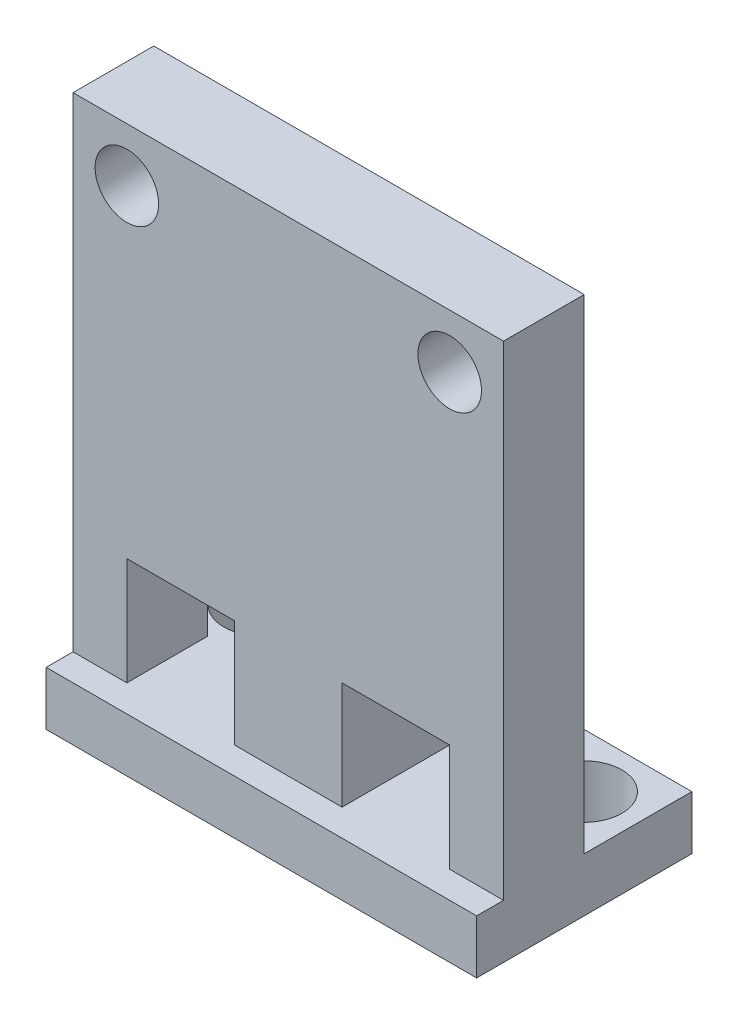
ISO-10303-21;
HEADER;
FILE_DESCRIPTION(('STEP AP214'),'2;1');
FILE_NAME('part.step','',(''),(''),'','','');
FILE_SCHEMA(('AUTOMOTIVE_DESIGN { 1 0 10303 214 1 1 1 1 }'));
ENDSEC;
DATA;
#1=APPLICATION_CONTEXT('core data for automotive mechanical design processes');
#2=APPLICATION_PROTOCOL_DEFINITION('international standard','automotive_design',2000,#1);
#3=PRODUCT_CONTEXT('',#1,'mechanical');
#4=PRODUCT('Part','Part','',(#3));
#5=PRODUCT_RELATED_PRODUCT_CATEGORY('part','',(#4));
#6=PRODUCT_DEFINITION_FORMATION('','',#4);
#7=PRODUCT_DEFINITION_CONTEXT('part definition',#1,'design');
#8=PRODUCT_DEFINITION('design','',#6,#7);
#9=PRODUCT_DEFINITION_SHAPE('','',#8);
#10=(LENGTH_UNIT() NAMED_UNIT(*) SI_UNIT(.MILLI.,.METRE.));
#11=(NAMED_UNIT(*) PLANE_ANGLE_UNIT() SI_UNIT($,.RADIAN.));
#12=(NAMED_UNIT(*) SI_UNIT($,.STERADIAN.) SOLID_ANGLE_UNIT());
#13=UNCERTAINTY_MEASURE_WITH_UNIT(LENGTH_MEASURE(1.E-05),#10,'distance_accuracy_value','');
#14=(GEOMETRIC_REPRESENTATION_CONTEXT(3) GLOBAL_UNCERTAINTY_ASSIGNED_CONTEXT((#13)) GLOBAL_UNIT_ASSIGNED_CONTEXT((#10,
#11,#12)) REPRESENTATION_CONTEXT('',''));
#15=CARTESIAN_POINT('',(0.,0.,0.));
#16=DIRECTION('',(0.,0.,1.));
#17=DIRECTION('',(1.,0.,0.));
#18=AXIS2_PLACEMENT_3D('',#15,#16,#17);
#19=CARTESIAN_POINT('',(0.,0.,0.));
#20=DIRECTION('',(0.,0.,-1.));
#21=DIRECTION('',(-1.,0.,0.));
#22=AXIS2_PLACEMENT_3D('',#19,#20,#21);
#23=PLANE('',#22);
#24=CARTESIAN_POINT('',(17.78,22.86,0.));
#25=DIRECTION('',(0.,0.,-1.));
#26=DIRECTION('',(-1.,0.,0.));
#27=AXIS2_PLACEMENT_3D('',#24,#25,#26);
#28=CIRCLE('',#27,1.499997);
#29=CARTESIAN_POINT('',(16.280003,22.86,0.));
#30=VERTEX_POINT('',#29);
#31=EDGE_CURVE('E266',#30,#30,#28,.F.);
#32=ORIENTED_EDGE('',*,*,#31,.T.);
#33=EDGE_LOOP('',(#32));
#34=FACE_BOUND('',#33,.T.);
#35=DIRECTION('',(1.,0.,0.));
#36=VECTOR('',#35,1.);
#37=CARTESIAN_POINT('',(0.,7.62,0.));
#38=LINE('',#37,#36);
#39=CARTESIAN_POINT('',(12.7,7.62,0.));
#40=VERTEX_POINT('',#39);
#41=CARTESIAN_POINT('',(17.78,7.62,0.));
#42=VERTEX_POINT('',#41);
#43=EDGE_CURVE('E211',#40,#42,#38,.T.);
#44=ORIENTED_EDGE('',*,*,#43,.F.);
#45=DIRECTION('',(0.,1.,0.));
#46=VECTOR('',#45,1.);
#47=CARTESIAN_POINT('',(12.7,0.,0.));
#48=LINE('',#47,#46);
#49=CARTESIAN_POINT('',(12.7,25.4,0.));
#50=VERTEX_POINT('',#49);
#51=EDGE_CURVE('E180',#40,#50,#48,.T.);
#52=ORIENTED_EDGE('',*,*,#51,.T.);
#53=DIRECTION('',(-1.,0.,0.));
#54=VECTOR('',#53,1.);
#55=CARTESIAN_POINT('',(0.,25.4,0.));
#56=LINE('',#55,#54);
#57=CARTESIAN_POINT('',(20.32,25.4,0.));
#58=VERTEX_POINT('',#57);
#59=EDGE_CURVE('E278',#58,#50,#56,.T.);
#60=ORIENTED_EDGE('',*,*,#59,.F.);
#61=DIRECTION('',(0.,1.,0.));
#62=VECTOR('',#61,1.);
#63=CARTESIAN_POINT('',(20.32,0.,0.));
#64=LINE('',#63,#62);
#65=CARTESIAN_POINT('',(20.32,2.54,0.));
#66=VERTEX_POINT('',#65);
#67=EDGE_CURVE('E286',#66,#58,#64,.T.);
#68=ORIENTED_EDGE('',*,*,#67,.F.);
#69=DIRECTION('',(-1.,0.,0.));
#70=VECTOR('',#69,1.);
#71=CARTESIAN_POINT('',(0.,2.54,0.));
#72=LINE('',#71,#70);
#73=CARTESIAN_POINT('',(17.78,2.54,0.));
#74=VERTEX_POINT('',#73);
#75=EDGE_CURVE('E301',#66,#74,#72,.T.);
#76=ORIENTED_EDGE('',*,*,#75,.T.);
#77=DIRECTION('',(0.,-1.,0.));
#78=VECTOR('',#77,1.);
#79=CARTESIAN_POINT('',(17.78,0.,0.));
#80=LINE('',#79,#78);
#81=EDGE_CURVE('E205',#42,#74,#80,.T.);
#82=ORIENTED_EDGE('',*,*,#81,.F.);
#83=EDGE_LOOP('',(#44,#52,#60,#68,#76,#82));
#84=FACE_BOUND('',#83,.T.);
#85=ADVANCED_FACE('F33',(#34,#84),#23,.T.);
#86=CARTESIAN_POINT('',(2.54,7.62,-5.08));
#87=DIRECTION('',(0.,1.,0.));
#88=DIRECTION('',(0.,0.,1.));
#89=AXIS2_PLACEMENT_3D('',#86,#87,#88);
#90=PLANE('',#89);
#91=DIRECTION('',(0.,0.,1.));
#92=VECTOR('',#91,1.);
#93=CARTESIAN_POINT('',(12.7,7.62,-5.08));
#94=LINE('',#93,#92);
#95=CARTESIAN_POINT('',(12.7,7.62,3.81));
#96=VERTEX_POINT('',#95);
#97=EDGE_CURVE('E11',#40,#96,#94,.T.);
#98=ORIENTED_EDGE('',*,*,#97,.F.);
#99=ORIENTED_EDGE('',*,*,#43,.T.);
#100=DIRECTION('',(0.,0.,1.));
#101=VECTOR('',#100,1.);
#102=CARTESIAN_POINT('',(17.78,7.62,-5.08));
#103=LINE('',#102,#101);
#104=CARTESIAN_POINT('',(17.78,7.62,3.81));
#105=VERTEX_POINT('',#104);
#106=EDGE_CURVE('E206',#42,#105,#103,.T.);
#107=ORIENTED_EDGE('',*,*,#106,.T.);
#108=DIRECTION('',(-1.,0.,0.));
#109=VECTOR('',#108,1.);
#110=CARTESIAN_POINT('',(2.54,7.62,3.81));
#111=LINE('',#110,#109);
#112=EDGE_CURVE('E200',#105,#96,#111,.T.);
#113=ORIENTED_EDGE('',*,*,#112,.T.);
#114=EDGE_LOOP('',(#98,#99,#107,#113));
#115=FACE_BOUND('',#114,.T.);
#116=ADVANCED_FACE('F363',(#115),#90,.F.);
#117=CARTESIAN_POINT('',(2.54,22.86,0.));
#118=DIRECTION('',(0.,0.,-1.));
#119=DIRECTION('',(-1.,0.,0.));
#120=AXIS2_PLACEMENT_3D('',#117,#118,#119);
#121=CIRCLE('',#120,1.499997);
#122=CARTESIAN_POINT('',(1.040003,22.86,0.));
#123=VERTEX_POINT('',#122);
#124=EDGE_CURVE('E269',#123,#123,#121,.F.);
#125=ORIENTED_EDGE('',*,*,#124,.T.);
#126=EDGE_LOOP('',(#125));
#127=FACE_BOUND('',#126,.T.);
#128=CARTESIAN_POINT('',(7.62,25.4,0.));
#129=VERTEX_POINT('',#128);
#130=CARTESIAN_POINT('',(0.,25.4,0.));
#131=VERTEX_POINT('',#130);
#132=EDGE_CURVE('E289',#129,#131,#56,.T.);
#133=ORIENTED_EDGE('',*,*,#132,.F.);
#134=DIRECTION('',(0.,-1.,0.));
#135=VECTOR('',#134,1.);
#136=CARTESIAN_POINT('',(7.62,0.,0.));
#137=LINE('',#136,#135);
#138=CARTESIAN_POINT('',(7.62,7.62,0.));
#139=VERTEX_POINT('',#138);
#140=EDGE_CURVE('E192',#129,#139,#137,.T.);
#141=ORIENTED_EDGE('',*,*,#140,.T.);
#142=CARTESIAN_POINT('',(2.54,7.62,0.));
#143=VERTEX_POINT('',#142);
#144=EDGE_CURVE('E212',#143,#139,#38,.T.);
#145=ORIENTED_EDGE('',*,*,#144,.F.);
#146=DIRECTION('',(0.,1.,0.));
#147=VECTOR('',#146,1.);
#148=CARTESIAN_POINT('',(2.54,0.,0.));
#149=LINE('',#148,#147);
#150=CARTESIAN_POINT('',(2.54,2.54,0.));
#151=VERTEX_POINT('',#150);
#152=EDGE_CURVE('E215',#151,#143,#149,.T.);
#153=ORIENTED_EDGE('',*,*,#152,.F.);
#154=CARTESIAN_POINT('',(0.,2.54,0.));
#155=VERTEX_POINT('',#154);
#156=EDGE_CURVE('E300',#151,#155,#72,.T.);
#157=ORIENTED_EDGE('',*,*,#156,.T.);
#158=DIRECTION('',(0.,-1.,0.));
#159=VECTOR('',#158,1.);
#160=CARTESIAN_POINT('',(0.,0.,0.));
#161=LINE('',#160,#159);
#162=EDGE_CURVE('E272',#131,#155,#161,.T.);
#163=ORIENTED_EDGE('',*,*,#162,.F.);
#164=EDGE_LOOP('',(#133,#141,#145,#153,#157,#163));
#165=FACE_BOUND('',#164,.T.);
#166=ADVANCED_FACE('F313',(#127,#165),#23,.T.);
#167=CARTESIAN_POINT('',(0.,2.54,0.));
#168=DIRECTION('',(0.,-1.,0.));
#169=DIRECTION('',(0.,0.,-1.));
#170=AXIS2_PLACEMENT_3D('',#167,#168,#169);
#171=PLANE('',#170);
#172=CARTESIAN_POINT('',(17.78,2.54,-2.54));
#173=DIRECTION('',(0.,1.,0.));
#174=DIRECTION('',(0.,0.,1.));
#175=AXIS2_PLACEMENT_3D('',#172,#173,#174);
#176=CIRCLE('',#175,1.778);
#177=CARTESIAN_POINT('',(17.78,2.54,-0.761999999999999));
#178=VERTEX_POINT('',#177);
#179=EDGE_CURVE('E222',#178,#178,#176,.T.);
#180=ORIENTED_EDGE('',*,*,#179,.F.);
#181=EDGE_LOOP('',(#180));
#182=FACE_BOUND('',#181,.T.);
#183=CARTESIAN_POINT('',(2.54,2.54,-2.54));
#184=DIRECTION('',(0.,1.,0.));
#185=DIRECTION('',(0.,0.,1.));
#186=AXIS2_PLACEMENT_3D('',#183,#184,#185);
#187=CIRCLE('',#186,1.778);
#188=CARTESIAN_POINT('',(2.54,2.54,-0.761999999999999));
#189=VERTEX_POINT('',#188);
#190=EDGE_CURVE('E217',#189,#189,#187,.T.);
#191=ORIENTED_EDGE('',*,*,#190,.F.);
#192=EDGE_LOOP('',(#191));
#193=FACE_BOUND('',#192,.T.);
#194=DIRECTION('',(0.,0.,1.));
#195=VECTOR('',#194,1.);
#196=CARTESIAN_POINT('',(12.7,2.54,-5.08));
#197=LINE('',#196,#195);
#198=CARTESIAN_POINT('',(12.7,2.54,-5.08));
#199=VERTEX_POINT('',#198);
#200=CARTESIAN_POINT('',(12.7,2.54,3.81));
#201=VERTEX_POINT('',#200);
#202=EDGE_CURVE('E169',#199,#201,#197,.T.);
#203=ORIENTED_EDGE('',*,*,#202,.T.);
#204=DIRECTION('',(1.,0.,0.));
#205=VECTOR('',#204,1.);
#206=CARTESIAN_POINT('',(7.62,2.54,3.81));
#207=LINE('',#206,#205);
#208=CARTESIAN_POINT('',(7.62,2.54,3.81));
#209=VERTEX_POINT('',#208);
#210=EDGE_CURVE('E153',#209,#201,#207,.T.);
#211=ORIENTED_EDGE('',*,*,#210,.F.);
#212=DIRECTION('',(0.,0.,1.));
#213=VECTOR('',#212,1.);
#214=CARTESIAN_POINT('',(7.62,2.54,-5.08));
#215=LINE('',#214,#213);
#216=CARTESIAN_POINT('',(7.62,2.54,-5.08));
#217=VERTEX_POINT('',#216);
#218=EDGE_CURVE('E188',#217,#209,#215,.T.);
#219=ORIENTED_EDGE('',*,*,#218,.F.);
#220=DIRECTION('',(1.,0.,0.));
#221=VECTOR('',#220,1.);
#222=CARTESIAN_POINT('',(0.,2.54,-5.08));
#223=LINE('',#222,#221);
#224=CARTESIAN_POINT('',(0.,2.54,-5.08));
#225=VERTEX_POINT('',#224);
#226=EDGE_CURVE('E253',#225,#217,#223,.T.);
#227=ORIENTED_EDGE('',*,*,#226,.F.);
#228=DIRECTION('',(0.,0.,-1.));
#229=VECTOR('',#228,1.);
#230=CARTESIAN_POINT('',(0.,2.54,5.08));
#231=LINE('',#230,#229);
#232=EDGE_CURVE('E251',#155,#225,#231,.T.);
#233=ORIENTED_EDGE('',*,*,#232,.F.);
#234=ORIENTED_EDGE('',*,*,#156,.F.);
#235=DIRECTION('',(0.,0.,1.));
#236=VECTOR('',#235,1.);
#237=CARTESIAN_POINT('',(2.54,2.54,-5.08));
#238=LINE('',#237,#236);
#239=CARTESIAN_POINT('',(2.54,2.54,3.81));
#240=VERTEX_POINT('',#239);
#241=EDGE_CURVE('E202',#151,#240,#238,.T.);
#242=ORIENTED_EDGE('',*,*,#241,.T.);
#243=DIRECTION('',(1.,0.,0.));
#244=VECTOR('',#243,1.);
#245=CARTESIAN_POINT('',(20.32,2.54,3.81));
#246=LINE('',#245,#244);
#247=CARTESIAN_POINT('',(0.,2.54,3.81));
#248=VERTEX_POINT('',#247);
#249=EDGE_CURVE('E237',#248,#240,#246,.T.);
#250=ORIENTED_EDGE('',*,*,#249,.F.);
#251=DIRECTION('',(0.,0.,1.));
#252=VECTOR('',#251,1.);
#253=CARTESIAN_POINT('',(0.,2.54,3.81));
#254=LINE('',#253,#252);
#255=CARTESIAN_POINT('',(0.,2.54,5.08));
#256=VERTEX_POINT('',#255);
#257=EDGE_CURVE('E240',#248,#256,#254,.T.);
#258=ORIENTED_EDGE('',*,*,#257,.T.);
#259=DIRECTION('',(1.,0.,0.));
#260=VECTOR('',#259,1.);
#261=CARTESIAN_POINT('',(20.32,2.54,5.08));
#262=LINE('',#261,#260);
#263=CARTESIAN_POINT('',(20.32,2.54,5.08));
#264=VERTEX_POINT('',#263);
#265=EDGE_CURVE('E221',#256,#264,#262,.T.);
#266=ORIENTED_EDGE('',*,*,#265,.T.);
#267=DIRECTION('',(0.,0.,1.));
#268=VECTOR('',#267,1.);
#269=CARTESIAN_POINT('',(20.32,2.54,3.81));
#270=LINE('',#269,#268);
#271=CARTESIAN_POINT('',(20.32,2.54,3.81));
#272=VERTEX_POINT('',#271);
#273=EDGE_CURVE('E242',#272,#264,#270,.T.);
#274=ORIENTED_EDGE('',*,*,#273,.F.);
#275=CARTESIAN_POINT('',(17.78,2.54,3.81));
#276=VERTEX_POINT('',#275);
#277=EDGE_CURVE('E236',#276,#272,#246,.T.);
#278=ORIENTED_EDGE('',*,*,#277,.F.);
#279=DIRECTION('',(0.,0.,1.));
#280=VECTOR('',#279,1.);
#281=CARTESIAN_POINT('',(17.78,2.54,-5.08));
#282=LINE('',#281,#280);
#283=EDGE_CURVE('E48',#74,#276,#282,.T.);
#284=ORIENTED_EDGE('',*,*,#283,.F.);
#285=ORIENTED_EDGE('',*,*,#75,.F.);
#286=DIRECTION('',(0.,0.,1.));
#287=VECTOR('',#286,1.);
#288=CARTESIAN_POINT('',(20.32,2.54,5.08));
#289=LINE('',#288,#287);
#290=CARTESIAN_POINT('',(20.32,2.54,-5.08));
#291=VERTEX_POINT('',#290);
#292=EDGE_CURVE('E256',#291,#66,#289,.T.);
#293=ORIENTED_EDGE('',*,*,#292,.F.);
#294=EDGE_CURVE('E176',#199,#291,#223,.T.);
#295=ORIENTED_EDGE('',*,*,#294,.F.);
#296=EDGE_LOOP('',(#203,#211,#219,#227,#233,#234,#242,#250,#258,#266,#274,#278,#284,#285,#293,#295));
#297=FACE_BOUND('',#296,.T.);
#298=ADVANCED_FACE('F174',(#182,#193,#297),#171,.F.);
#299=DIRECTION('',(0.,0.,-1.));
#300=VECTOR('',#299,1.);
#301=CARTESIAN_POINT('',(7.62,7.62,-5.08));
#302=LINE('',#301,#300);
#303=CARTESIAN_POINT('',(7.62,7.62,3.81));
#304=VERTEX_POINT('',#303);
#305=EDGE_CURVE('E41',#304,#139,#302,.T.);
#306=ORIENTED_EDGE('',*,*,#305,.F.);
#307=CARTESIAN_POINT('',(2.54,7.62,3.81));
#308=VERTEX_POINT('',#307);
#309=EDGE_CURVE('E199',#304,#308,#111,.T.);
#310=ORIENTED_EDGE('',*,*,#309,.T.);
#311=DIRECTION('',(0.,0.,1.));
#312=VECTOR('',#311,1.);
#313=CARTESIAN_POINT('',(2.54,7.62,-5.08));
#314=LINE('',#313,#312);
#315=EDGE_CURVE('E203',#143,#308,#314,.T.);
#316=ORIENTED_EDGE('',*,*,#315,.F.);
#317=ORIENTED_EDGE('',*,*,#144,.T.);
#318=EDGE_LOOP('',(#306,#310,#316,#317));
#319=FACE_BOUND('',#318,.T.);
#320=ADVANCED_FACE('F318',(#319),#90,.F.);
#321=CARTESIAN_POINT('',(0.,0.,5.08));
#322=DIRECTION('',(1.,0.,0.));
#323=DIRECTION('',(0.,0.,-1.));
#324=AXIS2_PLACEMENT_3D('',#321,#322,#323);
#325=PLANE('',#324);
#326=DIRECTION('',(0.,-1.,0.));
#327=VECTOR('',#326,1.);
#328=CARTESIAN_POINT('',(0.,0.,5.08));
#329=LINE('',#328,#327);
#330=CARTESIAN_POINT('',(0.,0.,5.08));
#331=VERTEX_POINT('',#330);
#332=EDGE_CURVE('E275',#256,#331,#329,.T.);
#333=ORIENTED_EDGE('',*,*,#332,.F.);
#334=ORIENTED_EDGE('',*,*,#257,.F.);
#335=DIRECTION('',(0.,-1.,0.));
#336=VECTOR('',#335,1.);
#337=CARTESIAN_POINT('',(0.,25.4,3.81));
#338=LINE('',#337,#336);
#339=CARTESIAN_POINT('',(0.,25.4,3.81));
#340=VERTEX_POINT('',#339);
#341=EDGE_CURVE('E234',#340,#248,#338,.T.);
#342=ORIENTED_EDGE('',*,*,#341,.F.);
#343=DIRECTION('',(0.,0.,-1.));
#344=VECTOR('',#343,1.);
#345=CARTESIAN_POINT('',(0.,25.4,5.08));
#346=LINE('',#345,#344);
#347=EDGE_CURVE('E283',#340,#131,#346,.T.);
#348=ORIENTED_EDGE('',*,*,#347,.T.);
#349=ORIENTED_EDGE('',*,*,#162,.T.);
#350=ORIENTED_EDGE('',*,*,#232,.T.);
#351=DIRECTION('',(0.,-1.,0.));
#352=VECTOR('',#351,1.);
#353=CARTESIAN_POINT('',(0.,2.54,-5.08));
#354=LINE('',#353,#352);
#355=CARTESIAN_POINT('',(0.,0.,-5.08));
#356=VERTEX_POINT('',#355);
#357=EDGE_CURVE('E260',#225,#356,#354,.T.);
#358=ORIENTED_EDGE('',*,*,#357,.T.);
#359=DIRECTION('',(0.,0.,-1.));
#360=VECTOR('',#359,1.);
#361=CARTESIAN_POINT('',(0.,0.,5.08));
#362=LINE('',#361,#360);
#363=EDGE_CURVE('E298',#331,#356,#362,.T.);
#364=ORIENTED_EDGE('',*,*,#363,.F.);
#365=EDGE_LOOP('',(#333,#334,#342,#348,#349,#350,#358,#364));
#366=FACE_BOUND('',#365,.T.);
#367=ADVANCED_FACE('F35',(#366),#325,.F.);
#368=CARTESIAN_POINT('',(0.,0.,5.08));
#369=DIRECTION('',(0.,1.,0.));
#370=DIRECTION('',(0.,0.,1.));
#371=AXIS2_PLACEMENT_3D('',#368,#369,#370);
#372=PLANE('',#371);
#373=CARTESIAN_POINT('',(17.78,0.,-2.54));
#374=DIRECTION('',(0.,1.,0.));
#375=DIRECTION('',(0.,0.,1.));
#376=AXIS2_PLACEMENT_3D('',#373,#374,#375);
#377=CIRCLE('',#376,1.778);
#378=CARTESIAN_POINT('',(17.78,0.,-0.761999999999999));
#379=VERTEX_POINT('',#378);
#380=EDGE_CURVE('E218',#379,#379,#377,.T.);
#381=ORIENTED_EDGE('',*,*,#380,.T.);
#382=EDGE_LOOP('',(#381));
#383=FACE_BOUND('',#382,.T.);
#384=CARTESIAN_POINT('',(2.54,0.,-2.54));
#385=DIRECTION('',(0.,1.,0.));
#386=DIRECTION('',(0.,0.,1.));
#387=AXIS2_PLACEMENT_3D('',#384,#385,#386);
#388=CIRCLE('',#387,1.778);
#389=CARTESIAN_POINT('',(2.54,0.,-0.761999999999999));
#390=VERTEX_POINT('',#389);
#391=EDGE_CURVE('E225',#390,#390,#388,.T.);
#392=ORIENTED_EDGE('',*,*,#391,.T.);
#393=EDGE_LOOP('',(#392));
#394=FACE_BOUND('',#393,.T.);
#395=ORIENTED_EDGE('',*,*,#363,.T.);
#396=DIRECTION('',(1.,0.,0.));
#397=VECTOR('',#396,1.);
#398=CARTESIAN_POINT('',(0.,0.,-5.08));
#399=LINE('',#398,#397);
#400=CARTESIAN_POINT('',(20.32,0.,-5.08));
#401=VERTEX_POINT('',#400);
#402=EDGE_CURVE('E250',#356,#401,#399,.T.);
#403=ORIENTED_EDGE('',*,*,#402,.T.);
#404=DIRECTION('',(0.,0.,-1.));
#405=VECTOR('',#404,1.);
#406=CARTESIAN_POINT('',(20.32,0.,5.08));
#407=LINE('',#406,#405);
#408=CARTESIAN_POINT('',(20.32,0.,5.08));
#409=VERTEX_POINT('',#408);
#410=EDGE_CURVE('E296',#409,#401,#407,.T.);
#411=ORIENTED_EDGE('',*,*,#410,.F.);
#412=DIRECTION('',(1.,0.,0.));
#413=VECTOR('',#412,1.);
#414=CARTESIAN_POINT('',(0.,0.,5.08));
#415=LINE('',#414,#413);
#416=EDGE_CURVE('E277',#331,#409,#415,.T.);
#417=ORIENTED_EDGE('',*,*,#416,.F.);
#418=EDGE_LOOP('',(#395,#403,#411,#417));
#419=FACE_BOUND('',#418,.T.);
#420=ADVANCED_FACE('F334',(#383,#394,#419),#372,.F.);
#421=CARTESIAN_POINT('',(20.32,0.,5.08));
#422=DIRECTION('',(-1.,0.,0.));
#423=DIRECTION('',(0.,0.,1.));
#424=AXIS2_PLACEMENT_3D('',#421,#422,#423);
#425=PLANE('',#424);
#426=DIRECTION('',(0.,1.,0.));
#427=VECTOR('',#426,1.);
#428=CARTESIAN_POINT('',(20.32,25.4,3.81));
#429=LINE('',#428,#427);
#430=CARTESIAN_POINT('',(20.32,25.4,3.81));
#431=VERTEX_POINT('',#430);
#432=EDGE_CURVE('E230',#272,#431,#429,.T.);
#433=ORIENTED_EDGE('',*,*,#432,.F.);
#434=ORIENTED_EDGE('',*,*,#273,.T.);
#435=DIRECTION('',(0.,1.,0.));
#436=VECTOR('',#435,1.);
#437=CARTESIAN_POINT('',(20.32,0.,5.08));
#438=LINE('',#437,#436);
#439=EDGE_CURVE('E280',#409,#264,#438,.T.);
#440=ORIENTED_EDGE('',*,*,#439,.F.);
#441=ORIENTED_EDGE('',*,*,#410,.T.);
#442=DIRECTION('',(0.,-1.,0.));
#443=VECTOR('',#442,1.);
#444=CARTESIAN_POINT('',(20.32,2.54,-5.08));
#445=LINE('',#444,#443);
#446=EDGE_CURVE('E263',#291,#401,#445,.T.);
#447=ORIENTED_EDGE('',*,*,#446,.F.);
#448=ORIENTED_EDGE('',*,*,#292,.T.);
#449=ORIENTED_EDGE('',*,*,#67,.T.);
#450=DIRECTION('',(0.,0.,-1.));
#451=VECTOR('',#450,1.);
#452=CARTESIAN_POINT('',(20.32,25.4,5.08));
#453=LINE('',#452,#451);
#454=EDGE_CURVE('E294',#431,#58,#453,.T.);
#455=ORIENTED_EDGE('',*,*,#454,.F.);
#456=EDGE_LOOP('',(#433,#434,#440,#441,#447,#448,#449,#455));
#457=FACE_BOUND('',#456,.T.);
#458=ADVANCED_FACE('F340',(#457),#425,.F.);
#459=CARTESIAN_POINT('',(0.,25.4,5.08));
#460=DIRECTION('',(0.,-1.,0.));
#461=DIRECTION('',(0.,0.,-1.));
#462=AXIS2_PLACEMENT_3D('',#459,#460,#461);
#463=PLANE('',#462);
#464=ORIENTED_EDGE('',*,*,#347,.F.);
#465=DIRECTION('',(-1.,0.,0.));
#466=VECTOR('',#465,1.);
#467=CARTESIAN_POINT('',(20.32,25.4,3.81));
#468=LINE('',#467,#466);
#469=EDGE_CURVE('E232',#431,#340,#468,.T.);
#470=ORIENTED_EDGE('',*,*,#469,.F.);
#471=ORIENTED_EDGE('',*,*,#454,.T.);
#472=ORIENTED_EDGE('',*,*,#59,.T.);
#473=DIRECTION('',(1.,0.,0.));
#474=VECTOR('',#473,1.);
#475=CARTESIAN_POINT('',(7.62,25.4,0.));
#476=LINE('',#475,#474);
#477=EDGE_CURVE('E164',#129,#50,#476,.T.);
#478=ORIENTED_EDGE('',*,*,#477,.F.);
#479=ORIENTED_EDGE('',*,*,#132,.T.);
#480=EDGE_LOOP('',(#464,#470,#471,#472,#478,#479));
#481=FACE_BOUND('',#480,.T.);
#482=ADVANCED_FACE('F361',(#481),#463,.F.);
#483=CARTESIAN_POINT('',(0.,0.,5.08));
#484=DIRECTION('',(0.,0.,-1.));
#485=DIRECTION('',(-1.,0.,0.));
#486=AXIS2_PLACEMENT_3D('',#483,#484,#485);
#487=PLANE('',#486);
#488=ORIENTED_EDGE('',*,*,#439,.T.);
#489=ORIENTED_EDGE('',*,*,#265,.F.);
#490=ORIENTED_EDGE('',*,*,#332,.T.);
#491=ORIENTED_EDGE('',*,*,#416,.T.);
#492=EDGE_LOOP('',(#488,#489,#490,#491));
#493=FACE_BOUND('',#492,.T.);
#494=ADVANCED_FACE('F331',(#493),#487,.F.);
#495=CARTESIAN_POINT('',(17.78,22.86,-0.00100000000000013));
#496=DIRECTION('',(0.,0.,1.));
#497=DIRECTION('',(1.,0.,0.));
#498=AXIS2_PLACEMENT_3D('',#495,#496,#497);
#499=CYLINDRICAL_SURFACE('',#498,1.499997);
#500=CARTESIAN_POINT('',(17.78,22.86,3.81));
#501=DIRECTION('',(0.,0.,-1.));
#502=DIRECTION('',(-1.,0.,0.));
#503=AXIS2_PLACEMENT_3D('',#500,#501,#502);
#504=CIRCLE('',#503,1.499997);
#505=CARTESIAN_POINT('',(16.280003,22.86,3.81));
#506=VERTEX_POINT('',#505);
#507=EDGE_CURVE('E247',#506,#506,#504,.F.);
#508=ORIENTED_EDGE('',*,*,#507,.T.);
#509=EDGE_LOOP('',(#508));
#510=FACE_BOUND('',#509,.T.);
#511=ORIENTED_EDGE('',*,*,#31,.F.);
#512=EDGE_LOOP('',(#511));
#513=FACE_BOUND('',#512,.T.);
#514=ADVANCED_FACE('F394',(#510,#513),#499,.F.);
#515=CARTESIAN_POINT('',(2.54,22.86,-0.00100000000000013));
#516=DIRECTION('',(0.,0.,1.));
#517=DIRECTION('',(1.,0.,0.));
#518=AXIS2_PLACEMENT_3D('',#515,#516,#517);
#519=CYLINDRICAL_SURFACE('',#518,1.499997);
#520=CARTESIAN_POINT('',(2.54,22.86,3.81));
#521=DIRECTION('',(0.,0.,-1.));
#522=DIRECTION('',(-1.,0.,0.));
#523=AXIS2_PLACEMENT_3D('',#520,#521,#522);
#524=CIRCLE('',#523,1.499997);
#525=CARTESIAN_POINT('',(1.040003,22.86,3.81));
#526=VERTEX_POINT('',#525);
#527=EDGE_CURVE('E245',#526,#526,#524,.F.);
#528=ORIENTED_EDGE('',*,*,#527,.T.);
#529=EDGE_LOOP('',(#528));
#530=FACE_BOUND('',#529,.T.);
#531=ORIENTED_EDGE('',*,*,#124,.F.);
#532=EDGE_LOOP('',(#531));
#533=FACE_BOUND('',#532,.T.);
#534=ADVANCED_FACE('F391',(#530,#533),#519,.F.);
#535=CARTESIAN_POINT('',(0.,2.54,-5.08));
#536=DIRECTION('',(0.,0.,-1.));
#537=DIRECTION('',(-1.,0.,0.));
#538=AXIS2_PLACEMENT_3D('',#535,#536,#537);
#539=PLANE('',#538);
#540=ORIENTED_EDGE('',*,*,#402,.F.);
#541=ORIENTED_EDGE('',*,*,#357,.F.);
#542=ORIENTED_EDGE('',*,*,#226,.T.);
#543=EDGE_CURVE('E257',#217,#199,#223,.T.);
#544=ORIENTED_EDGE('',*,*,#543,.T.);
#545=ORIENTED_EDGE('',*,*,#294,.T.);
#546=ORIENTED_EDGE('',*,*,#446,.T.);
#547=EDGE_LOOP('',(#540,#541,#542,#544,#545,#546));
#548=FACE_BOUND('',#547,.T.);
#549=ADVANCED_FACE('F354',(#548),#539,.T.);
#550=CARTESIAN_POINT('',(0.,0.,3.81));
#551=DIRECTION('',(0.,0.,-1.));
#552=DIRECTION('',(-1.,0.,0.));
#553=AXIS2_PLACEMENT_3D('',#550,#551,#552);
#554=PLANE('',#553);
#555=ORIENTED_EDGE('',*,*,#469,.T.);
#556=ORIENTED_EDGE('',*,*,#341,.T.);
#557=ORIENTED_EDGE('',*,*,#249,.T.);
#558=DIRECTION('',(0.,-1.,0.));
#559=VECTOR('',#558,1.);
#560=CARTESIAN_POINT('',(2.54,2.54,3.81));
#561=LINE('',#560,#559);
#562=EDGE_CURVE('E56',#308,#240,#561,.T.);
#563=ORIENTED_EDGE('',*,*,#562,.F.);
#564=ORIENTED_EDGE('',*,*,#309,.F.);
#565=DIRECTION('',(0.,1.,0.));
#566=VECTOR('',#565,1.);
#567=CARTESIAN_POINT('',(7.62,2.54,3.81));
#568=LINE('',#567,#566);
#569=EDGE_CURVE('E161',#209,#304,#568,.T.);
#570=ORIENTED_EDGE('',*,*,#569,.F.);
#571=ORIENTED_EDGE('',*,*,#210,.T.);
#572=DIRECTION('',(0.,1.,0.));
#573=VECTOR('',#572,1.);
#574=CARTESIAN_POINT('',(12.7,2.54,3.81));
#575=LINE('',#574,#573);
#576=EDGE_CURVE('E158',#201,#96,#575,.T.);
#577=ORIENTED_EDGE('',*,*,#576,.T.);
#578=ORIENTED_EDGE('',*,*,#112,.F.);
#579=DIRECTION('',(0.,1.,0.));
#580=VECTOR('',#579,1.);
#581=CARTESIAN_POINT('',(17.78,2.54,3.81));
#582=LINE('',#581,#580);
#583=EDGE_CURVE('E196',#276,#105,#582,.T.);
#584=ORIENTED_EDGE('',*,*,#583,.F.);
#585=ORIENTED_EDGE('',*,*,#277,.T.);
#586=ORIENTED_EDGE('',*,*,#432,.T.);
#587=EDGE_LOOP('',(#555,#556,#557,#563,#564,#570,#571,#577,#578,#584,#585,#586));
#588=FACE_BOUND('',#587,.T.);
#589=ORIENTED_EDGE('',*,*,#527,.F.);
#590=EDGE_LOOP('',(#589));
#591=FACE_BOUND('',#590,.T.);
#592=ORIENTED_EDGE('',*,*,#507,.F.);
#593=EDGE_LOOP('',(#592));
#594=FACE_BOUND('',#593,.T.);
#595=ADVANCED_FACE('F155',(#588,#591,#594),#554,.F.);
#596=CARTESIAN_POINT('',(2.54,0.,-2.54));
#597=DIRECTION('',(0.,1.,0.));
#598=DIRECTION('',(0.,0.,1.));
#599=AXIS2_PLACEMENT_3D('',#596,#597,#598);
#600=CYLINDRICAL_SURFACE('',#599,1.778);
#601=ORIENTED_EDGE('',*,*,#391,.F.);
#602=EDGE_LOOP('',(#601));
#603=FACE_BOUND('',#602,.T.);
#604=ORIENTED_EDGE('',*,*,#190,.T.);
#605=EDGE_LOOP('',(#604));
#606=FACE_BOUND('',#605,.T.);
#607=ADVANCED_FACE('F412',(#603,#606),#600,.F.);
#608=CARTESIAN_POINT('',(17.78,0.,-2.54));
#609=DIRECTION('',(0.,1.,0.));
#610=DIRECTION('',(0.,0.,1.));
#611=AXIS2_PLACEMENT_3D('',#608,#609,#610);
#612=CYLINDRICAL_SURFACE('',#611,1.778);
#613=ORIENTED_EDGE('',*,*,#380,.F.);
#614=EDGE_LOOP('',(#613));
#615=FACE_BOUND('',#614,.T.);
#616=ORIENTED_EDGE('',*,*,#179,.T.);
#617=EDGE_LOOP('',(#616));
#618=FACE_BOUND('',#617,.T.);
#619=ADVANCED_FACE('F415',(#615,#618),#612,.F.);
#620=CARTESIAN_POINT('',(2.54,2.54,-5.08));
#621=DIRECTION('',(-1.,0.,0.));
#622=DIRECTION('',(0.,0.,1.));
#623=AXIS2_PLACEMENT_3D('',#620,#621,#622);
#624=PLANE('',#623);
#625=ORIENTED_EDGE('',*,*,#152,.T.);
#626=ORIENTED_EDGE('',*,*,#315,.T.);
#627=ORIENTED_EDGE('',*,*,#562,.T.);
#628=ORIENTED_EDGE('',*,*,#241,.F.);
#629=EDGE_LOOP('',(#625,#626,#627,#628));
#630=FACE_BOUND('',#629,.T.);
#631=ADVANCED_FACE('F319',(#630),#624,.F.);
#632=CARTESIAN_POINT('',(17.78,2.54,-5.08));
#633=DIRECTION('',(1.,0.,0.));
#634=DIRECTION('',(0.,0.,-1.));
#635=AXIS2_PLACEMENT_3D('',#632,#633,#634);
#636=PLANE('',#635);
#637=ORIENTED_EDGE('',*,*,#81,.T.);
#638=ORIENTED_EDGE('',*,*,#283,.T.);
#639=ORIENTED_EDGE('',*,*,#583,.T.);
#640=ORIENTED_EDGE('',*,*,#106,.F.);
#641=EDGE_LOOP('',(#637,#638,#639,#640));
#642=FACE_BOUND('',#641,.T.);
#643=ADVANCED_FACE('F347',(#642),#636,.F.);
#644=CARTESIAN_POINT('',(7.62,25.4,0.));
#645=DIRECTION('',(0.,-0.216930457818656,0.976187060183953));
#646=DIRECTION('',(0.,-0.976187060183953,-0.216930457818656));
#647=AXIS2_PLACEMENT_3D('',#644,#645,#646);
#648=PLANE('',#647);
#649=ORIENTED_EDGE('',*,*,#477,.T.);
#650=DIRECTION('',(0.,-0.976187060183953,-0.216930457818656));
#651=VECTOR('',#650,1.);
#652=CARTESIAN_POINT('',(12.7,25.4,0.));
#653=LINE('',#652,#651);
#654=EDGE_CURVE('E178',#50,#199,#653,.T.);
#655=ORIENTED_EDGE('',*,*,#654,.T.);
#656=ORIENTED_EDGE('',*,*,#543,.F.);
#657=DIRECTION('',(0.,-0.976187060183953,-0.216930457818656));
#658=VECTOR('',#657,1.);
#659=CARTESIAN_POINT('',(7.62,25.4,0.));
#660=LINE('',#659,#658);
#661=EDGE_CURVE('E185',#129,#217,#660,.T.);
#662=ORIENTED_EDGE('',*,*,#661,.F.);
#663=EDGE_LOOP('',(#649,#655,#656,#662));
#664=FACE_BOUND('',#663,.T.);
#665=ADVANCED_FACE('F358',(#664),#648,.F.);
#666=CARTESIAN_POINT('',(7.62,0.,0.));
#667=DIRECTION('',(1.,0.,0.));
#668=DIRECTION('',(0.,0.,-1.));
#669=AXIS2_PLACEMENT_3D('',#666,#667,#668);
#670=PLANE('',#669);
#671=ORIENTED_EDGE('',*,*,#140,.F.);
#672=ORIENTED_EDGE('',*,*,#661,.T.);
#673=ORIENTED_EDGE('',*,*,#218,.T.);
#674=ORIENTED_EDGE('',*,*,#569,.T.);
#675=ORIENTED_EDGE('',*,*,#305,.T.);
#676=EDGE_LOOP('',(#671,#672,#673,#674,#675));
#677=FACE_BOUND('',#676,.T.);
#678=ADVANCED_FACE('F307',(#677),#670,.F.);
#679=CARTESIAN_POINT('',(12.7,0.,0.));
#680=DIRECTION('',(-1.,0.,0.));
#681=DIRECTION('',(0.,0.,-1.));
#682=AXIS2_PLACEMENT_3D('',#679,#680,#681);
#683=PLANE('',#682);
#684=ORIENTED_EDGE('',*,*,#51,.F.);
#685=ORIENTED_EDGE('',*,*,#97,.T.);
#686=ORIENTED_EDGE('',*,*,#576,.F.);
#687=ORIENTED_EDGE('',*,*,#202,.F.);
#688=ORIENTED_EDGE('',*,*,#654,.F.);
#689=EDGE_LOOP('',(#684,#685,#686,#687,#688));
#690=FACE_BOUND('',#689,.T.);
#691=ADVANCED_FACE('F167',(#690),#683,.F.);
#692=CLOSED_SHELL('',(#85,#116,#166,#298,#320,#367,#420,#458,#482,#494,#514,#534,#549,#595,#607,
#619,#631,#643,#665,#678,#691));
#693=MANIFOLD_SOLID_BREP('B2',#692);
#694=ADVANCED_BREP_SHAPE_REPRESENTATION('',(#18,#693),#14);
#695=SHAPE_DEFINITION_REPRESENTATION(#9,#694);
ENDSEC;
END-ISO-10303-21;
